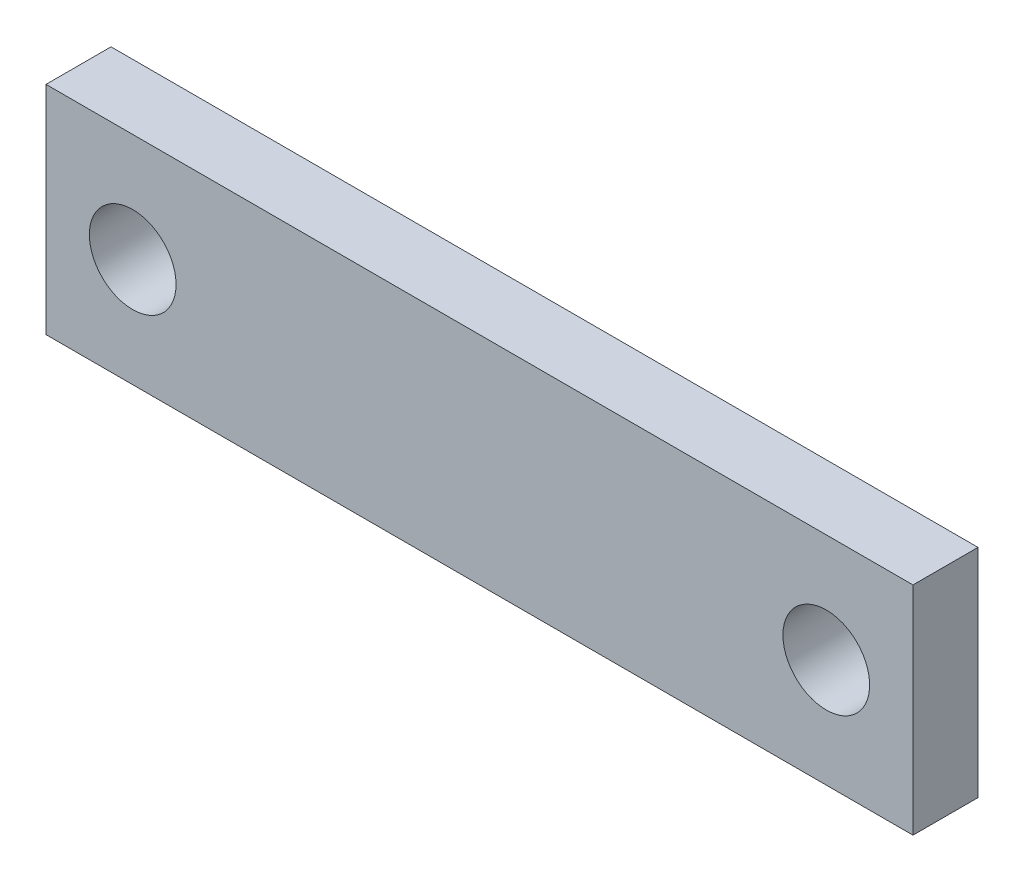
ISO-10303-21;
HEADER;
FILE_DESCRIPTION(('STEP AP214'),'2;1');
FILE_NAME('part.step','',(''),(''),'','','');
FILE_SCHEMA(('AUTOMOTIVE_DESIGN { 1 0 10303 214 1 1 1 1 }'));
ENDSEC;
DATA;
#1=APPLICATION_CONTEXT('core data for automotive mechanical design processes');
#2=APPLICATION_PROTOCOL_DEFINITION('international standard','automotive_design',2000,#1);
#3=PRODUCT_CONTEXT('',#1,'mechanical');
#4=PRODUCT('Part','Part','',(#3));
#5=PRODUCT_RELATED_PRODUCT_CATEGORY('part','',(#4));
#6=PRODUCT_DEFINITION_FORMATION('','',#4);
#7=PRODUCT_DEFINITION_CONTEXT('part definition',#1,'design');
#8=PRODUCT_DEFINITION('design','',#6,#7);
#9=PRODUCT_DEFINITION_SHAPE('','',#8);
#10=(LENGTH_UNIT() NAMED_UNIT(*) SI_UNIT(.MILLI.,.METRE.));
#11=(NAMED_UNIT(*) PLANE_ANGLE_UNIT() SI_UNIT($,.RADIAN.));
#12=(NAMED_UNIT(*) SI_UNIT($,.STERADIAN.) SOLID_ANGLE_UNIT());
#13=UNCERTAINTY_MEASURE_WITH_UNIT(LENGTH_MEASURE(1.E-05),#10,'distance_accuracy_value','');
#14=(GEOMETRIC_REPRESENTATION_CONTEXT(3) GLOBAL_UNCERTAINTY_ASSIGNED_CONTEXT((#13)) GLOBAL_UNIT_ASSIGNED_CONTEXT((#10,
#11,#12)) REPRESENTATION_CONTEXT('',''));
#15=CARTESIAN_POINT('',(0.,0.,0.));
#16=DIRECTION('',(0.,0.,1.));
#17=DIRECTION('',(1.,0.,0.));
#18=AXIS2_PLACEMENT_3D('',#15,#16,#17);
#19=CARTESIAN_POINT('',(0.,0.,1.5));
#20=DIRECTION('',(0.,0.,1.));
#21=DIRECTION('',(1.,0.,0.));
#22=AXIS2_PLACEMENT_3D('',#19,#20,#21);
#23=PLANE('',#22);
#24=CARTESIAN_POINT('',(-8.,0.,1.5));
#25=DIRECTION('',(0.,0.,1.));
#26=DIRECTION('',(1.,0.,0.));
#27=AXIS2_PLACEMENT_3D('',#24,#25,#26);
#28=CIRCLE('',#27,0.999999999999998);
#29=CARTESIAN_POINT('',(-7.,0.,1.5));
#30=VERTEX_POINT('',#29);
#31=EDGE_CURVE('E99',#30,#30,#28,.T.);
#32=ORIENTED_EDGE('',*,*,#31,.F.);
#33=EDGE_LOOP('',(#32));
#34=FACE_BOUND('',#33,.T.);
#35=DIRECTION('',(0.,1.,0.));
#36=VECTOR('',#35,1.);
#37=CARTESIAN_POINT('',(10.,2.5,1.5));
#38=LINE('',#37,#36);
#39=CARTESIAN_POINT('',(10.,-2.5,1.5));
#40=VERTEX_POINT('',#39);
#41=CARTESIAN_POINT('',(10.,2.5,1.5));
#42=VERTEX_POINT('',#41);
#43=EDGE_CURVE('E84',#40,#42,#38,.T.);
#44=ORIENTED_EDGE('',*,*,#43,.T.);
#45=DIRECTION('',(-1.,0.,0.));
#46=VECTOR('',#45,1.);
#47=CARTESIAN_POINT('',(-10.,2.5,1.5));
#48=LINE('',#47,#46);
#49=CARTESIAN_POINT('',(-10.,2.5,1.5));
#50=VERTEX_POINT('',#49);
#51=EDGE_CURVE('E79',#42,#50,#48,.T.);
#52=ORIENTED_EDGE('',*,*,#51,.T.);
#53=DIRECTION('',(0.,-1.,0.));
#54=VECTOR('',#53,1.);
#55=CARTESIAN_POINT('',(-10.,2.5,1.5));
#56=LINE('',#55,#54);
#57=CARTESIAN_POINT('',(-10.,-2.5,1.5));
#58=VERTEX_POINT('',#57);
#59=EDGE_CURVE('E82',#50,#58,#56,.T.);
#60=ORIENTED_EDGE('',*,*,#59,.T.);
#61=DIRECTION('',(1.,0.,0.));
#62=VECTOR('',#61,1.);
#63=CARTESIAN_POINT('',(-10.,-2.5,1.5));
#64=LINE('',#63,#62);
#65=EDGE_CURVE('E49',#58,#40,#64,.T.);
#66=ORIENTED_EDGE('',*,*,#65,.T.);
#67=EDGE_LOOP('',(#44,#52,#60,#66));
#68=FACE_BOUND('',#67,.T.);
#69=CARTESIAN_POINT('',(8.,0.,1.5));
#70=DIRECTION('',(0.,0.,1.));
#71=DIRECTION('',(-1.,0.,0.));
#72=AXIS2_PLACEMENT_3D('',#69,#70,#71);
#73=CIRCLE('',#72,0.999999999999998);
#74=CARTESIAN_POINT('',(7.,0.,1.5));
#75=VERTEX_POINT('',#74);
#76=EDGE_CURVE('E114',#75,#75,#73,.T.);
#77=ORIENTED_EDGE('',*,*,#76,.F.);
#78=EDGE_LOOP('',(#77));
#79=FACE_BOUND('',#78,.T.);
#80=ADVANCED_FACE('F32',(#34,#68,#79),#23,.T.);
#81=CARTESIAN_POINT('',(0.,0.,0.));
#82=DIRECTION('',(0.,0.,1.));
#83=DIRECTION('',(1.,0.,0.));
#84=AXIS2_PLACEMENT_3D('',#81,#82,#83);
#85=PLANE('',#84);
#86=DIRECTION('',(0.,1.,0.));
#87=VECTOR('',#86,1.);
#88=CARTESIAN_POINT('',(10.,2.5,0.));
#89=LINE('',#88,#87);
#90=CARTESIAN_POINT('',(10.,-2.5,0.));
#91=VERTEX_POINT('',#90);
#92=CARTESIAN_POINT('',(10.,2.5,0.));
#93=VERTEX_POINT('',#92);
#94=EDGE_CURVE('E96',#91,#93,#89,.T.);
#95=ORIENTED_EDGE('',*,*,#94,.F.);
#96=DIRECTION('',(1.,0.,0.));
#97=VECTOR('',#96,1.);
#98=CARTESIAN_POINT('',(-10.,-2.5,0.));
#99=LINE('',#98,#97);
#100=CARTESIAN_POINT('',(-10.,-2.5,0.));
#101=VERTEX_POINT('',#100);
#102=EDGE_CURVE('E72',#101,#91,#99,.T.);
#103=ORIENTED_EDGE('',*,*,#102,.F.);
#104=DIRECTION('',(0.,-1.,0.));
#105=VECTOR('',#104,1.);
#106=CARTESIAN_POINT('',(-10.,2.5,0.));
#107=LINE('',#106,#105);
#108=CARTESIAN_POINT('',(-10.,2.5,0.));
#109=VERTEX_POINT('',#108);
#110=EDGE_CURVE('E66',#109,#101,#107,.T.);
#111=ORIENTED_EDGE('',*,*,#110,.F.);
#112=DIRECTION('',(-1.,0.,0.));
#113=VECTOR('',#112,1.);
#114=CARTESIAN_POINT('',(-10.,2.5,0.));
#115=LINE('',#114,#113);
#116=EDGE_CURVE('E88',#93,#109,#115,.T.);
#117=ORIENTED_EDGE('',*,*,#116,.F.);
#118=EDGE_LOOP('',(#95,#103,#111,#117));
#119=FACE_BOUND('',#118,.T.);
#120=CARTESIAN_POINT('',(-8.,0.,0.));
#121=DIRECTION('',(0.,0.,1.));
#122=DIRECTION('',(1.,0.,0.));
#123=AXIS2_PLACEMENT_3D('',#120,#121,#122);
#124=CIRCLE('',#123,0.999999999999998);
#125=CARTESIAN_POINT('',(-7.,0.,0.));
#126=VERTEX_POINT('',#125);
#127=EDGE_CURVE('E111',#126,#126,#124,.T.);
#128=ORIENTED_EDGE('',*,*,#127,.T.);
#129=EDGE_LOOP('',(#128));
#130=FACE_BOUND('',#129,.T.);
#131=CARTESIAN_POINT('',(8.,0.,0.));
#132=DIRECTION('',(0.,0.,1.));
#133=DIRECTION('',(-1.,0.,0.));
#134=AXIS2_PLACEMENT_3D('',#131,#132,#133);
#135=CIRCLE('',#134,0.999999999999998);
#136=CARTESIAN_POINT('',(7.,0.,0.));
#137=VERTEX_POINT('',#136);
#138=EDGE_CURVE('E117',#137,#137,#135,.T.);
#139=ORIENTED_EDGE('',*,*,#138,.T.);
#140=EDGE_LOOP('',(#139));
#141=FACE_BOUND('',#140,.T.);
#142=ADVANCED_FACE('F107',(#119,#130,#141),#85,.F.);
#143=CARTESIAN_POINT('',(10.,2.5,1.5));
#144=DIRECTION('',(-1.,0.,0.));
#145=DIRECTION('',(0.,-1.,0.));
#146=AXIS2_PLACEMENT_3D('',#143,#144,#145);
#147=PLANE('',#146);
#148=ORIENTED_EDGE('',*,*,#94,.T.);
#149=DIRECTION('',(0.,0.,-1.));
#150=VECTOR('',#149,1.);
#151=CARTESIAN_POINT('',(10.,2.5,1.5));
#152=LINE('',#151,#150);
#153=EDGE_CURVE('E11',#42,#93,#152,.T.);
#154=ORIENTED_EDGE('',*,*,#153,.F.);
#155=ORIENTED_EDGE('',*,*,#43,.F.);
#156=DIRECTION('',(0.,0.,-1.));
#157=VECTOR('',#156,1.);
#158=CARTESIAN_POINT('',(10.,-2.5,1.5));
#159=LINE('',#158,#157);
#160=EDGE_CURVE('E92',#40,#91,#159,.T.);
#161=ORIENTED_EDGE('',*,*,#160,.T.);
#162=EDGE_LOOP('',(#148,#154,#155,#161));
#163=FACE_BOUND('',#162,.T.);
#164=ADVANCED_FACE('F34',(#163),#147,.F.);
#165=CARTESIAN_POINT('',(-10.,2.5,1.5));
#166=DIRECTION('',(0.,-1.,0.));
#167=DIRECTION('',(1.,0.,0.));
#168=AXIS2_PLACEMENT_3D('',#165,#166,#167);
#169=PLANE('',#168);
#170=ORIENTED_EDGE('',*,*,#116,.T.);
#171=DIRECTION('',(0.,0.,-1.));
#172=VECTOR('',#171,1.);
#173=CARTESIAN_POINT('',(-10.,2.5,1.5));
#174=LINE('',#173,#172);
#175=EDGE_CURVE('E41',#50,#109,#174,.T.);
#176=ORIENTED_EDGE('',*,*,#175,.F.);
#177=ORIENTED_EDGE('',*,*,#51,.F.);
#178=ORIENTED_EDGE('',*,*,#153,.T.);
#179=EDGE_LOOP('',(#170,#176,#177,#178));
#180=FACE_BOUND('',#179,.T.);
#181=ADVANCED_FACE('F87',(#180),#169,.F.);
#182=CARTESIAN_POINT('',(-10.,2.5,1.5));
#183=DIRECTION('',(1.,0.,0.));
#184=DIRECTION('',(0.,0.,-1.));
#185=AXIS2_PLACEMENT_3D('',#182,#183,#184);
#186=PLANE('',#185);
#187=ORIENTED_EDGE('',*,*,#110,.T.);
#188=DIRECTION('',(0.,0.,-1.));
#189=VECTOR('',#188,1.);
#190=CARTESIAN_POINT('',(-10.,-2.5,1.5));
#191=LINE('',#190,#189);
#192=EDGE_CURVE('E89',#58,#101,#191,.T.);
#193=ORIENTED_EDGE('',*,*,#192,.F.);
#194=ORIENTED_EDGE('',*,*,#59,.F.);
#195=ORIENTED_EDGE('',*,*,#175,.T.);
#196=EDGE_LOOP('',(#187,#193,#194,#195));
#197=FACE_BOUND('',#196,.T.);
#198=ADVANCED_FACE('F90',(#197),#186,.F.);
#199=CARTESIAN_POINT('',(-10.,-2.5,1.5));
#200=DIRECTION('',(0.,1.,0.));
#201=DIRECTION('',(-1.,0.,0.));
#202=AXIS2_PLACEMENT_3D('',#199,#200,#201);
#203=PLANE('',#202);
#204=ORIENTED_EDGE('',*,*,#102,.T.);
#205=ORIENTED_EDGE('',*,*,#160,.F.);
#206=ORIENTED_EDGE('',*,*,#65,.F.);
#207=ORIENTED_EDGE('',*,*,#192,.T.);
#208=EDGE_LOOP('',(#204,#205,#206,#207));
#209=FACE_BOUND('',#208,.T.);
#210=ADVANCED_FACE('F104',(#209),#203,.F.);
#211=CARTESIAN_POINT('',(-8.,0.,1.5));
#212=DIRECTION('',(0.,0.,-1.));
#213=DIRECTION('',(-1.,0.,0.));
#214=AXIS2_PLACEMENT_3D('',#211,#212,#213);
#215=CYLINDRICAL_SURFACE('',#214,0.999999999999998);
#216=ORIENTED_EDGE('',*,*,#31,.T.);
#217=EDGE_LOOP('',(#216));
#218=FACE_BOUND('',#217,.T.);
#219=ORIENTED_EDGE('',*,*,#127,.F.);
#220=EDGE_LOOP('',(#219));
#221=FACE_BOUND('',#220,.T.);
#222=ADVANCED_FACE('F134',(#218,#221),#215,.F.);
#223=CARTESIAN_POINT('',(8.,0.,1.5));
#224=DIRECTION('',(0.,0.,-1.));
#225=DIRECTION('',(-1.,0.,0.));
#226=AXIS2_PLACEMENT_3D('',#223,#224,#225);
#227=CYLINDRICAL_SURFACE('',#226,0.999999999999998);
#228=ORIENTED_EDGE('',*,*,#76,.T.);
#229=EDGE_LOOP('',(#228));
#230=FACE_BOUND('',#229,.T.);
#231=ORIENTED_EDGE('',*,*,#138,.F.);
#232=EDGE_LOOP('',(#231));
#233=FACE_BOUND('',#232,.T.);
#234=ADVANCED_FACE('F123',(#230,#233),#227,.F.);
#235=CLOSED_SHELL('',(#80,#142,#164,#181,#198,#210,#222,#234));
#236=MANIFOLD_SOLID_BREP('B2',#235);
#237=ADVANCED_BREP_SHAPE_REPRESENTATION('',(#18,#236),#14);
#238=SHAPE_DEFINITION_REPRESENTATION(#9,#237);
ENDSEC;
END-ISO-10303-21;
